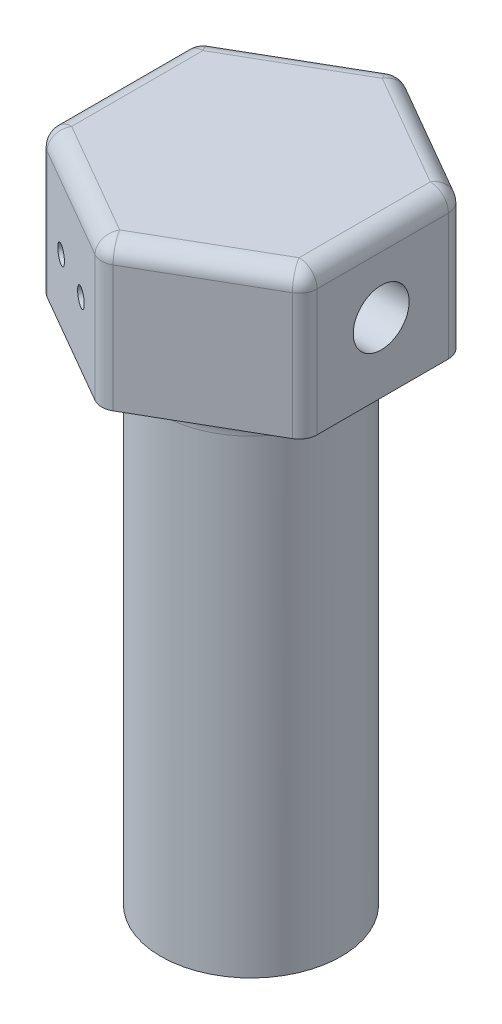
ISO-10303-21;
HEADER;
FILE_DESCRIPTION(('STEP AP214'),'2;1');
FILE_NAME('part.step','',(''),(''),'','','');
FILE_SCHEMA(('AUTOMOTIVE_DESIGN { 1 0 10303 214 1 1 1 1 }'));
ENDSEC;
DATA;
#1=APPLICATION_CONTEXT('core data for automotive mechanical design processes');
#2=APPLICATION_PROTOCOL_DEFINITION('international standard','automotive_design',2000,#1);
#3=PRODUCT_CONTEXT('',#1,'mechanical');
#4=PRODUCT('Part','Part','',(#3));
#5=PRODUCT_RELATED_PRODUCT_CATEGORY('part','',(#4));
#6=PRODUCT_DEFINITION_FORMATION('','',#4);
#7=PRODUCT_DEFINITION_CONTEXT('part definition',#1,'design');
#8=PRODUCT_DEFINITION('design','',#6,#7);
#9=PRODUCT_DEFINITION_SHAPE('','',#8);
#10=(LENGTH_UNIT() NAMED_UNIT(*) SI_UNIT(.MILLI.,.METRE.));
#11=(NAMED_UNIT(*) PLANE_ANGLE_UNIT() SI_UNIT($,.RADIAN.));
#12=(NAMED_UNIT(*) SI_UNIT($,.STERADIAN.) SOLID_ANGLE_UNIT());
#13=UNCERTAINTY_MEASURE_WITH_UNIT(LENGTH_MEASURE(1.E-05),#10,'distance_accuracy_value','');
#14=(GEOMETRIC_REPRESENTATION_CONTEXT(3) GLOBAL_UNCERTAINTY_ASSIGNED_CONTEXT((#13)) GLOBAL_UNIT_ASSIGNED_CONTEXT((#10,
#11,#12)) REPRESENTATION_CONTEXT('',''));
#15=CARTESIAN_POINT('',(0.,0.,0.));
#16=DIRECTION('',(0.,0.,1.));
#17=DIRECTION('',(1.,0.,0.));
#18=AXIS2_PLACEMENT_3D('',#15,#16,#17);
#19=CARTESIAN_POINT('',(-1.15,-28.,1.11242977306435));
#20=DIRECTION('',(1.,0.,0.));
#21=DIRECTION('',(0.,0.,-1.));
#22=AXIS2_PLACEMENT_3D('',#19,#20,#21);
#23=PLANE('',#22);
#24=DIRECTION('',(0.,1.,0.));
#25=VECTOR('',#24,1.);
#26=CARTESIAN_POINT('',(-1.15,-28.,1.11242977306435));
#27=LINE('',#26,#25);
#28=CARTESIAN_POINT('',(-1.15,-24.,1.11242977306435));
#29=VERTEX_POINT('',#28);
#30=CARTESIAN_POINT('',(-1.15,0.,1.11242977306435));
#31=VERTEX_POINT('',#30);
#32=EDGE_CURVE('E177',#29,#31,#27,.T.);
#33=ORIENTED_EDGE('',*,*,#32,.F.);
#34=DIRECTION('',(0.,0.,-1.));
#35=VECTOR('',#34,1.);
#36=CARTESIAN_POINT('',(-1.15,-24.,1.11242977306435));
#37=LINE('',#36,#35);
#38=CARTESIAN_POINT('',(-1.15,-24.,-1.11242977306435));
#39=VERTEX_POINT('',#38);
#40=EDGE_CURVE('E12',#29,#39,#37,.T.);
#41=ORIENTED_EDGE('',*,*,#40,.T.);
#42=DIRECTION('',(0.,1.,0.));
#43=VECTOR('',#42,1.);
#44=CARTESIAN_POINT('',(-1.15,-28.,-1.11242977306435));
#45=LINE('',#44,#43);
#46=CARTESIAN_POINT('',(-1.15,0.,-1.11242977306435));
#47=VERTEX_POINT('',#46);
#48=EDGE_CURVE('E179',#39,#47,#45,.T.);
#49=ORIENTED_EDGE('',*,*,#48,.T.);
#50=DIRECTION('',(0.,0.,-1.));
#51=VECTOR('',#50,1.);
#52=CARTESIAN_POINT('',(-1.15,0.,1.11242977306435));
#53=LINE('',#52,#51);
#54=EDGE_CURVE('E185',#31,#47,#53,.T.);
#55=ORIENTED_EDGE('',*,*,#54,.F.);
#56=EDGE_LOOP('',(#33,#41,#49,#55));
#57=FACE_BOUND('',#56,.T.);
#58=ADVANCED_FACE('F52',(#57),#23,.T.);
#59=CARTESIAN_POINT('',(0.,0.,0.));
#60=DIRECTION('',(0.,1.,0.));
#61=DIRECTION('',(0.,0.,1.));
#62=AXIS2_PLACEMENT_3D('',#59,#60,#61);
#63=PLANE('',#62);
#64=CARTESIAN_POINT('',(0.,0.,0.));
#65=DIRECTION('',(0.,1.,0.));
#66=DIRECTION('',(0.,0.,1.));
#67=AXIS2_PLACEMENT_3D('',#64,#65,#66);
#68=CIRCLE('',#67,7.);
#69=CARTESIAN_POINT('',(0.,0.,7.));
#70=VERTEX_POINT('',#69);
#71=EDGE_CURVE('E225',#70,#70,#68,.T.);
#72=ORIENTED_EDGE('',*,*,#71,.T.);
#73=EDGE_LOOP('',(#72));
#74=FACE_BOUND('',#73,.T.);
#75=DIRECTION('',(0.,0.,1.));
#76=VECTOR('',#75,1.);
#77=CARTESIAN_POINT('',(-7.3,0.,-4.21465696508427));
#78=LINE('',#77,#76);
#79=CARTESIAN_POINT('',(-7.3,0.,-3.63730669589464));
#80=VERTEX_POINT('',#79);
#81=CARTESIAN_POINT('',(-7.3,0.,3.63730669589464));
#82=VERTEX_POINT('',#81);
#83=EDGE_CURVE('E213',#80,#82,#78,.T.);
#84=ORIENTED_EDGE('',*,*,#83,.F.);
#85=CARTESIAN_POINT('',(-6.3,0.,-3.63730669589464));
#86=DIRECTION('',(0.,1.,0.));
#87=DIRECTION('',(0.,0.,1.));
#88=AXIS2_PLACEMENT_3D('',#85,#86,#87);
#89=CIRCLE('',#88,1.);
#90=CARTESIAN_POINT('',(-6.8,0.,-4.50333209967908));
#91=VERTEX_POINT('',#90);
#92=EDGE_CURVE('E61',#80,#91,#89,.F.);
#93=ORIENTED_EDGE('',*,*,#92,.T.);
#94=DIRECTION('',(-0.866025403784439,0.,0.5));
#95=VECTOR('',#94,1.);
#96=CARTESIAN_POINT('',(0.,0.,-8.42931393016854));
#97=LINE('',#96,#95);
#98=CARTESIAN_POINT('',(-0.5,0.,-8.14063879557373));
#99=VERTEX_POINT('',#98);
#100=EDGE_CURVE('E209',#99,#91,#97,.T.);
#101=ORIENTED_EDGE('',*,*,#100,.F.);
#102=CARTESIAN_POINT('',(0.,0.,-7.27461339178929));
#103=DIRECTION('',(0.,1.,0.));
#104=DIRECTION('',(0.,0.,1.));
#105=AXIS2_PLACEMENT_3D('',#102,#103,#104);
#106=CIRCLE('',#105,1.);
#107=CARTESIAN_POINT('',(0.5,0.,-8.14063879557372));
#108=VERTEX_POINT('',#107);
#109=EDGE_CURVE('E314',#99,#108,#106,.F.);
#110=ORIENTED_EDGE('',*,*,#109,.T.);
#111=DIRECTION('',(-0.866025403784439,0.,-0.5));
#112=VECTOR('',#111,1.);
#113=CARTESIAN_POINT('',(7.3,0.,-4.21465696508427));
#114=LINE('',#113,#112);
#115=CARTESIAN_POINT('',(6.8,0.,-4.50333209967908));
#116=VERTEX_POINT('',#115);
#117=EDGE_CURVE('E205',#116,#108,#114,.T.);
#118=ORIENTED_EDGE('',*,*,#117,.F.);
#119=CARTESIAN_POINT('',(6.3,0.,-3.63730669589465));
#120=DIRECTION('',(0.,1.,0.));
#121=DIRECTION('',(0.,0.,1.));
#122=AXIS2_PLACEMENT_3D('',#119,#120,#121);
#123=CIRCLE('',#122,1.);
#124=CARTESIAN_POINT('',(7.3,0.,-3.63730669589465));
#125=VERTEX_POINT('',#124);
#126=EDGE_CURVE('E311',#116,#125,#123,.F.);
#127=ORIENTED_EDGE('',*,*,#126,.T.);
#128=DIRECTION('',(0.,0.,-1.));
#129=VECTOR('',#128,1.);
#130=CARTESIAN_POINT('',(7.3,0.,4.21465696508427));
#131=LINE('',#130,#129);
#132=CARTESIAN_POINT('',(7.3,0.,3.63730669589464));
#133=VERTEX_POINT('',#132);
#134=EDGE_CURVE('E201',#133,#125,#131,.T.);
#135=ORIENTED_EDGE('',*,*,#134,.F.);
#136=CARTESIAN_POINT('',(6.3,0.,3.63730669589464));
#137=DIRECTION('',(0.,1.,0.));
#138=DIRECTION('',(0.,0.,1.));
#139=AXIS2_PLACEMENT_3D('',#136,#137,#138);
#140=CIRCLE('',#139,1.);
#141=CARTESIAN_POINT('',(6.8,0.,4.50333209967908));
#142=VERTEX_POINT('',#141);
#143=EDGE_CURVE('E308',#133,#142,#140,.F.);
#144=ORIENTED_EDGE('',*,*,#143,.T.);
#145=DIRECTION('',(0.866025403784439,0.,-0.5));
#146=VECTOR('',#145,1.);
#147=CARTESIAN_POINT('',(0.,0.,8.42931393016854));
#148=LINE('',#147,#146);
#149=CARTESIAN_POINT('',(0.500000000000001,0.,8.14063879557373));
#150=VERTEX_POINT('',#149);
#151=EDGE_CURVE('E193',#150,#142,#148,.T.);
#152=ORIENTED_EDGE('',*,*,#151,.F.);
#153=CARTESIAN_POINT('',(0.,0.,7.27461339178929));
#154=DIRECTION('',(0.,1.,0.));
#155=DIRECTION('',(0.,0.,1.));
#156=AXIS2_PLACEMENT_3D('',#153,#154,#155);
#157=CIRCLE('',#156,1.);
#158=CARTESIAN_POINT('',(-0.5,0.,8.14063879557373));
#159=VERTEX_POINT('',#158);
#160=EDGE_CURVE('E305',#150,#159,#157,.F.);
#161=ORIENTED_EDGE('',*,*,#160,.T.);
#162=DIRECTION('',(0.866025403784438,0.,0.5));
#163=VECTOR('',#162,1.);
#164=CARTESIAN_POINT('',(-7.3,0.,4.21465696508427));
#165=LINE('',#164,#163);
#166=CARTESIAN_POINT('',(-6.8,0.,4.50333209967908));
#167=VERTEX_POINT('',#166);
#168=EDGE_CURVE('E217',#167,#159,#165,.T.);
#169=ORIENTED_EDGE('',*,*,#168,.F.);
#170=CARTESIAN_POINT('',(-6.3,0.,3.63730669589464));
#171=DIRECTION('',(0.,1.,0.));
#172=DIRECTION('',(0.,0.,1.));
#173=AXIS2_PLACEMENT_3D('',#170,#171,#172);
#174=CIRCLE('',#173,1.);
#175=EDGE_CURVE('E302',#167,#82,#174,.F.);
#176=ORIENTED_EDGE('',*,*,#175,.T.);
#177=EDGE_LOOP('',(#84,#93,#101,#110,#118,#127,#135,#144,#152,#161,#169,#176));
#178=FACE_BOUND('',#177,.T.);
#179=ADVANCED_FACE('F412',(#74,#178),#63,.F.);
#180=CARTESIAN_POINT('',(0.,8.,8.42931393016854));
#181=DIRECTION('',(-0.5,0.,-0.866025403784439));
#182=DIRECTION('',(-0.866025403784439,0.,0.5));
#183=AXIS2_PLACEMENT_3D('',#180,#181,#182);
#184=PLANE('',#183);
#185=ORIENTED_EDGE('',*,*,#151,.T.);
#186=DIRECTION('',(0.,-1.,0.));
#187=VECTOR('',#186,1.);
#188=CARTESIAN_POINT('',(6.8,8.,4.50333209967908));
#189=LINE('',#188,#187);
#190=CARTESIAN_POINT('',(6.8,7.,4.50333209967908));
#191=VERTEX_POINT('',#190);
#192=EDGE_CURVE('E74',#142,#191,#189,.F.);
#193=ORIENTED_EDGE('',*,*,#192,.T.);
#194=DIRECTION('',(0.866025403784439,0.,-0.5));
#195=VECTOR('',#194,1.);
#196=CARTESIAN_POINT('',(0.,7.,8.42931393016854));
#197=LINE('',#196,#195);
#198=CARTESIAN_POINT('',(0.5,7.,8.14063879557373));
#199=VERTEX_POINT('',#198);
#200=EDGE_CURVE('E297',#191,#199,#197,.F.);
#201=ORIENTED_EDGE('',*,*,#200,.T.);
#202=DIRECTION('',(0.,-1.,0.));
#203=VECTOR('',#202,1.);
#204=CARTESIAN_POINT('',(0.5,8.,8.14063879557373));
#205=LINE('',#204,#203);
#206=EDGE_CURVE('E294',#199,#150,#205,.T.);
#207=ORIENTED_EDGE('',*,*,#206,.T.);
#208=EDGE_LOOP('',(#185,#193,#201,#207));
#209=FACE_BOUND('',#208,.T.);
#210=ADVANCED_FACE('F426',(#209),#184,.F.);
#211=CARTESIAN_POINT('',(7.3,8.,4.21465696508427));
#212=DIRECTION('',(-1.,0.,0.));
#213=DIRECTION('',(0.,0.,1.));
#214=AXIS2_PLACEMENT_3D('',#211,#212,#213);
#215=PLANE('',#214);
#216=CARTESIAN_POINT('',(7.3,3.85,0.0853430349157284));
#217=DIRECTION('',(1.,0.,0.));
#218=DIRECTION('',(0.,0.,-1.));
#219=AXIS2_PLACEMENT_3D('',#216,#217,#218);
#220=CIRCLE('',#219,1.55);
#221=CARTESIAN_POINT('',(7.3,3.85,-1.46465696508427));
#222=VERTEX_POINT('',#221);
#223=EDGE_CURVE('E386',#222,#222,#220,.T.);
#224=ORIENTED_EDGE('',*,*,#223,.F.);
#225=EDGE_LOOP('',(#224));
#226=FACE_BOUND('',#225,.T.);
#227=ORIENTED_EDGE('',*,*,#134,.T.);
#228=DIRECTION('',(0.,-1.,0.));
#229=VECTOR('',#228,1.);
#230=CARTESIAN_POINT('',(7.3,8.,-3.63730669589465));
#231=LINE('',#230,#229);
#232=CARTESIAN_POINT('',(7.3,7.,-3.63730669589465));
#233=VERTEX_POINT('',#232);
#234=EDGE_CURVE('E291',#125,#233,#231,.F.);
#235=ORIENTED_EDGE('',*,*,#234,.T.);
#236=DIRECTION('',(0.,0.,-1.));
#237=VECTOR('',#236,1.);
#238=CARTESIAN_POINT('',(7.3,7.,4.21465696508427));
#239=LINE('',#238,#237);
#240=CARTESIAN_POINT('',(7.3,7.,3.63730669589464));
#241=VERTEX_POINT('',#240);
#242=EDGE_CURVE('E288',#233,#241,#239,.F.);
#243=ORIENTED_EDGE('',*,*,#242,.T.);
#244=DIRECTION('',(0.,-1.,0.));
#245=VECTOR('',#244,1.);
#246=CARTESIAN_POINT('',(7.3,8.,3.63730669589464));
#247=LINE('',#246,#245);
#248=EDGE_CURVE('E285',#241,#133,#247,.T.);
#249=ORIENTED_EDGE('',*,*,#248,.T.);
#250=EDGE_LOOP('',(#227,#235,#243,#249));
#251=FACE_BOUND('',#250,.T.);
#252=ADVANCED_FACE('F491',(#226,#251),#215,.F.);
#253=CARTESIAN_POINT('',(7.3,8.,-4.21465696508427));
#254=DIRECTION('',(-0.5,0.,0.866025403784439));
#255=DIRECTION('',(0.866025403784439,0.,0.5));
#256=AXIS2_PLACEMENT_3D('',#253,#254,#255);
#257=PLANE('',#256);
#258=ORIENTED_EDGE('',*,*,#117,.T.);
#259=DIRECTION('',(0.,-1.,0.));
#260=VECTOR('',#259,1.);
#261=CARTESIAN_POINT('',(0.5,8.,-8.14063879557372));
#262=LINE('',#261,#260);
#263=CARTESIAN_POINT('',(0.499999999999999,7.,-8.14063879557372));
#264=VERTEX_POINT('',#263);
#265=EDGE_CURVE('E282',#108,#264,#262,.F.);
#266=ORIENTED_EDGE('',*,*,#265,.T.);
#267=DIRECTION('',(-0.866025403784439,0.,-0.5));
#268=VECTOR('',#267,1.);
#269=CARTESIAN_POINT('',(7.3,7.,-4.21465696508427));
#270=LINE('',#269,#268);
#271=CARTESIAN_POINT('',(6.8,7.,-4.50333209967908));
#272=VERTEX_POINT('',#271);
#273=EDGE_CURVE('E279',#264,#272,#270,.F.);
#274=ORIENTED_EDGE('',*,*,#273,.T.);
#275=DIRECTION('',(0.,-1.,0.));
#276=VECTOR('',#275,1.);
#277=CARTESIAN_POINT('',(6.8,8.,-4.50333209967908));
#278=LINE('',#277,#276);
#279=EDGE_CURVE('E276',#272,#116,#278,.T.);
#280=ORIENTED_EDGE('',*,*,#279,.T.);
#281=EDGE_LOOP('',(#258,#266,#274,#280));
#282=FACE_BOUND('',#281,.T.);
#283=ADVANCED_FACE('F540',(#282),#257,.F.);
#284=CARTESIAN_POINT('',(0.,8.,-8.42931393016854));
#285=DIRECTION('',(0.5,0.,0.866025403784439));
#286=DIRECTION('',(0.866025403784439,0.,-0.5));
#287=AXIS2_PLACEMENT_3D('',#284,#285,#286);
#288=PLANE('',#287);
#289=ORIENTED_EDGE('',*,*,#100,.T.);
#290=DIRECTION('',(0.,-1.,0.));
#291=VECTOR('',#290,1.);
#292=CARTESIAN_POINT('',(-6.8,8.,-4.50333209967908));
#293=LINE('',#292,#291);
#294=CARTESIAN_POINT('',(-6.8,7.,-4.50333209967908));
#295=VERTEX_POINT('',#294);
#296=EDGE_CURVE('E273',#91,#295,#293,.F.);
#297=ORIENTED_EDGE('',*,*,#296,.T.);
#298=DIRECTION('',(-0.866025403784439,0.,0.5));
#299=VECTOR('',#298,1.);
#300=CARTESIAN_POINT('',(0.,7.,-8.42931393016854));
#301=LINE('',#300,#299);
#302=CARTESIAN_POINT('',(-0.500000000000001,7.,-8.14063879557373));
#303=VERTEX_POINT('',#302);
#304=EDGE_CURVE('E270',#295,#303,#301,.F.);
#305=ORIENTED_EDGE('',*,*,#304,.T.);
#306=DIRECTION('',(0.,-1.,0.));
#307=VECTOR('',#306,1.);
#308=CARTESIAN_POINT('',(-0.500000000000001,8.,-8.14063879557373));
#309=LINE('',#308,#307);
#310=EDGE_CURVE('E267',#303,#99,#309,.T.);
#311=ORIENTED_EDGE('',*,*,#310,.T.);
#312=EDGE_LOOP('',(#289,#297,#305,#311));
#313=FACE_BOUND('',#312,.T.);
#314=ADVANCED_FACE('F590',(#313),#288,.F.);
#315=CARTESIAN_POINT('',(-7.3,8.,-4.21465696508427));
#316=DIRECTION('',(1.,0.,0.));
#317=DIRECTION('',(0.,0.,-1.));
#318=AXIS2_PLACEMENT_3D('',#315,#316,#317);
#319=PLANE('',#318);
#320=CARTESIAN_POINT('',(-7.3,3.85,0.0853430349157314));
#321=DIRECTION('',(1.,0.,0.));
#322=DIRECTION('',(0.,0.,-1.));
#323=AXIS2_PLACEMENT_3D('',#320,#321,#322);
#324=CIRCLE('',#323,1.55);
#325=CARTESIAN_POINT('',(-7.3,3.85,-1.46465696508427));
#326=VERTEX_POINT('',#325);
#327=EDGE_CURVE('E392',#326,#326,#324,.T.);
#328=ORIENTED_EDGE('',*,*,#327,.T.);
#329=EDGE_LOOP('',(#328));
#330=FACE_BOUND('',#329,.T.);
#331=DIRECTION('',(0.,0.,1.));
#332=VECTOR('',#331,1.);
#333=CARTESIAN_POINT('',(-7.3,7.,-4.21465696508427));
#334=LINE('',#333,#332);
#335=CARTESIAN_POINT('',(-7.3,7.,3.63730669589464));
#336=VERTEX_POINT('',#335);
#337=CARTESIAN_POINT('',(-7.3,7.,-3.63730669589464));
#338=VERTEX_POINT('',#337);
#339=EDGE_CURVE('E261',#336,#338,#334,.F.);
#340=ORIENTED_EDGE('',*,*,#339,.T.);
#341=DIRECTION('',(0.,-1.,0.));
#342=VECTOR('',#341,1.);
#343=CARTESIAN_POINT('',(-7.3,8.,-3.63730669589464));
#344=LINE('',#343,#342);
#345=EDGE_CURVE('E264',#338,#80,#344,.T.);
#346=ORIENTED_EDGE('',*,*,#345,.T.);
#347=ORIENTED_EDGE('',*,*,#83,.T.);
#348=DIRECTION('',(0.,-1.,0.));
#349=VECTOR('',#348,1.);
#350=CARTESIAN_POINT('',(-7.3,8.,3.63730669589464));
#351=LINE('',#350,#349);
#352=EDGE_CURVE('E258',#82,#336,#351,.F.);
#353=ORIENTED_EDGE('',*,*,#352,.T.);
#354=EDGE_LOOP('',(#340,#346,#347,#353));
#355=FACE_BOUND('',#354,.T.);
#356=ADVANCED_FACE('F448',(#330,#355),#319,.F.);
#357=CARTESIAN_POINT('',(-7.3,8.,4.21465696508427));
#358=DIRECTION('',(0.5,0.,-0.866025403784439));
#359=DIRECTION('',(-0.866025403784438,0.,-0.5));
#360=AXIS2_PLACEMENT_3D('',#357,#358,#359);
#361=PLANE('',#360);
#362=CARTESIAN_POINT('',(-4.94903810567666,3.5,5.5719854476264));
#363=DIRECTION('',(-0.5,0.,0.866025403784439));
#364=DIRECTION('',(0.866025403784439,0.,0.5));
#365=AXIS2_PLACEMENT_3D('',#362,#363,#364);
#366=CIRCLE('',#365,0.5);
#367=CARTESIAN_POINT('',(-4.51602540378444,3.5,5.8219854476264));
#368=VERTEX_POINT('',#367);
#369=EDGE_CURVE('E922',#368,#368,#366,.T.);
#370=ORIENTED_EDGE('',*,*,#369,.F.);
#371=EDGE_LOOP('',(#370));
#372=FACE_BOUND('',#371,.T.);
#373=CARTESIAN_POINT('',(-2.35096189432334,3.5,7.0719854476264));
#374=DIRECTION('',(-0.5,0.,0.866025403784439));
#375=DIRECTION('',(0.866025403784439,0.,0.5));
#376=AXIS2_PLACEMENT_3D('',#373,#374,#375);
#377=CIRCLE('',#376,0.499999999999999);
#378=CARTESIAN_POINT('',(-1.91794919243112,3.5,7.3219854476264));
#379=VERTEX_POINT('',#378);
#380=EDGE_CURVE('E926',#379,#379,#377,.T.);
#381=ORIENTED_EDGE('',*,*,#380,.F.);
#382=EDGE_LOOP('',(#381));
#383=FACE_BOUND('',#382,.T.);
#384=ORIENTED_EDGE('',*,*,#168,.T.);
#385=DIRECTION('',(0.,-1.,0.));
#386=VECTOR('',#385,1.);
#387=CARTESIAN_POINT('',(-0.5,8.,8.14063879557373));
#388=LINE('',#387,#386);
#389=CARTESIAN_POINT('',(-0.5,7.,8.14063879557373));
#390=VERTEX_POINT('',#389);
#391=EDGE_CURVE('E255',#159,#390,#388,.F.);
#392=ORIENTED_EDGE('',*,*,#391,.T.);
#393=DIRECTION('',(0.866025403784438,0.,0.5));
#394=VECTOR('',#393,1.);
#395=CARTESIAN_POINT('',(-7.3,7.,4.21465696508427));
#396=LINE('',#395,#394);
#397=CARTESIAN_POINT('',(-6.8,7.,4.50333209967908));
#398=VERTEX_POINT('',#397);
#399=EDGE_CURVE('E251',#390,#398,#396,.F.);
#400=ORIENTED_EDGE('',*,*,#399,.T.);
#401=DIRECTION('',(0.,-1.,0.));
#402=VECTOR('',#401,1.);
#403=CARTESIAN_POINT('',(-6.8,8.,4.50333209967908));
#404=LINE('',#403,#402);
#405=EDGE_CURVE('E248',#398,#167,#404,.T.);
#406=ORIENTED_EDGE('',*,*,#405,.T.);
#407=EDGE_LOOP('',(#384,#392,#400,#406));
#408=FACE_BOUND('',#407,.T.);
#409=ADVANCED_FACE('F443',(#372,#383,#408),#361,.F.);
#410=CARTESIAN_POINT('',(0.,8.,0.));
#411=DIRECTION('',(0.,1.,0.));
#412=DIRECTION('',(0.,0.,1.));
#413=AXIS2_PLACEMENT_3D('',#410,#411,#412);
#414=PLANE('',#413);
#415=DIRECTION('',(0.,0.,1.));
#416=VECTOR('',#415,1.);
#417=CARTESIAN_POINT('',(-6.3,8.,4.21465696508427));
#418=LINE('',#417,#416);
#419=CARTESIAN_POINT('',(-6.3,8.,-3.63730669589464));
#420=VERTEX_POINT('',#419);
#421=CARTESIAN_POINT('',(-6.3,8.,3.63730669589464));
#422=VERTEX_POINT('',#421);
#423=EDGE_CURVE('E241',#420,#422,#418,.T.);
#424=ORIENTED_EDGE('',*,*,#423,.T.);
#425=DIRECTION('',(0.866025403784438,0.,0.5));
#426=VECTOR('',#425,1.);
#427=CARTESIAN_POINT('',(0.499999999999999,8.,7.5632885263841));
#428=LINE('',#427,#426);
#429=CARTESIAN_POINT('',(0.,8.,7.27461339178929));
#430=VERTEX_POINT('',#429);
#431=EDGE_CURVE('E244',#422,#430,#428,.T.);
#432=ORIENTED_EDGE('',*,*,#431,.T.);
#433=DIRECTION('',(0.866025403784439,0.,-0.5));
#434=VECTOR('',#433,1.);
#435=CARTESIAN_POINT('',(6.8,8.,3.34863156129983));
#436=LINE('',#435,#434);
#437=CARTESIAN_POINT('',(6.3,8.,3.63730669589465));
#438=VERTEX_POINT('',#437);
#439=EDGE_CURVE('E229',#430,#438,#436,.T.);
#440=ORIENTED_EDGE('',*,*,#439,.T.);
#441=DIRECTION('',(0.,0.,-1.));
#442=VECTOR('',#441,1.);
#443=CARTESIAN_POINT('',(6.3,8.,-4.21465696508427));
#444=LINE('',#443,#442);
#445=CARTESIAN_POINT('',(6.3,8.,-3.63730669589465));
#446=VERTEX_POINT('',#445);
#447=EDGE_CURVE('E232',#438,#446,#444,.T.);
#448=ORIENTED_EDGE('',*,*,#447,.T.);
#449=DIRECTION('',(-0.866025403784439,0.,-0.5));
#450=VECTOR('',#449,1.);
#451=CARTESIAN_POINT('',(-0.500000000000001,8.,-7.5632885263841));
#452=LINE('',#451,#450);
#453=CARTESIAN_POINT('',(0.,8.,-7.27461339178929));
#454=VERTEX_POINT('',#453);
#455=EDGE_CURVE('E235',#446,#454,#452,.T.);
#456=ORIENTED_EDGE('',*,*,#455,.T.);
#457=DIRECTION('',(-0.866025403784439,0.,0.5));
#458=VECTOR('',#457,1.);
#459=CARTESIAN_POINT('',(-6.8,8.,-3.34863156129983));
#460=LINE('',#459,#458);
#461=EDGE_CURVE('E238',#454,#420,#460,.T.);
#462=ORIENTED_EDGE('',*,*,#461,.T.);
#463=EDGE_LOOP('',(#424,#432,#440,#448,#456,#462));
#464=FACE_BOUND('',#463,.T.);
#465=ADVANCED_FACE('F438',(#464),#414,.T.);
#466=CARTESIAN_POINT('',(0.,-28.,0.));
#467=DIRECTION('',(0.,-1.,0.));
#468=DIRECTION('',(0.,0.,-1.));
#469=AXIS2_PLACEMENT_3D('',#466,#467,#468);
#470=PLANE('',#469);
#471=CARTESIAN_POINT('',(0.,-28.,0.));
#472=DIRECTION('',(0.,-1.,0.));
#473=DIRECTION('',(0.,0.,-1.));
#474=AXIS2_PLACEMENT_3D('',#471,#472,#473);
#475=CIRCLE('',#474,1.6);
#476=CARTESIAN_POINT('',(0.,-28.,-1.6));
#477=VERTEX_POINT('',#476);
#478=EDGE_CURVE('E195',#477,#477,#475,.T.);
#479=ORIENTED_EDGE('',*,*,#478,.F.);
#480=EDGE_LOOP('',(#479));
#481=FACE_BOUND('',#480,.T.);
#482=CARTESIAN_POINT('',(0.,-28.,0.));
#483=DIRECTION('',(0.,-1.,0.));
#484=DIRECTION('',(0.,0.,-1.));
#485=AXIS2_PLACEMENT_3D('',#482,#483,#484);
#486=CIRCLE('',#485,5.);
#487=CARTESIAN_POINT('',(0.,-28.,-5.));
#488=VERTEX_POINT('',#487);
#489=EDGE_CURVE('E188',#488,#488,#486,.T.);
#490=ORIENTED_EDGE('',*,*,#489,.T.);
#491=EDGE_LOOP('',(#490));
#492=FACE_BOUND('',#491,.T.);
#493=ADVANCED_FACE('F435',(#481,#492),#470,.T.);
#494=CARTESIAN_POINT('',(0.,-28.,0.));
#495=DIRECTION('',(0.,1.,0.));
#496=DIRECTION('',(0.,0.,1.));
#497=AXIS2_PLACEMENT_3D('',#494,#495,#496);
#498=CYLINDRICAL_SURFACE('',#497,5.);
#499=CARTESIAN_POINT('',(0.,-2.,0.));
#500=DIRECTION('',(0.,1.,0.));
#501=DIRECTION('',(0.,0.,1.));
#502=AXIS2_PLACEMENT_3D('',#499,#500,#501);
#503=CIRCLE('',#502,5.);
#504=CARTESIAN_POINT('',(0.,-2.,5.));
#505=VERTEX_POINT('',#504);
#506=EDGE_CURVE('E221',#505,#505,#503,.F.);
#507=ORIENTED_EDGE('',*,*,#506,.T.);
#508=EDGE_LOOP('',(#507));
#509=FACE_BOUND('',#508,.T.);
#510=ORIENTED_EDGE('',*,*,#489,.F.);
#511=EDGE_LOOP('',(#510));
#512=FACE_BOUND('',#511,.T.);
#513=ADVANCED_FACE('F420',(#509,#512),#498,.T.);
#514=CARTESIAN_POINT('',(0.,-28.,0.));
#515=DIRECTION('',(0.,1.,0.));
#516=DIRECTION('',(0.,0.,1.));
#517=AXIS2_PLACEMENT_3D('',#514,#515,#516);
#518=CYLINDRICAL_SURFACE('',#517,1.6);
#519=CARTESIAN_POINT('',(0.,-24.,0.));
#520=DIRECTION('',(0.,-1.,0.));
#521=DIRECTION('',(0.,0.,-1.));
#522=AXIS2_PLACEMENT_3D('',#519,#520,#521);
#523=CIRCLE('',#522,1.6);
#524=EDGE_CURVE('E67',#29,#39,#523,.T.);
#525=ORIENTED_EDGE('',*,*,#524,.F.);
#526=ORIENTED_EDGE('',*,*,#32,.T.);
#527=CARTESIAN_POINT('',(0.,0.,0.));
#528=DIRECTION('',(0.,-1.,0.));
#529=DIRECTION('',(0.,0.,-1.));
#530=AXIS2_PLACEMENT_3D('',#527,#528,#529);
#531=CIRCLE('',#530,1.6);
#532=EDGE_CURVE('E398',#47,#31,#531,.T.);
#533=ORIENTED_EDGE('',*,*,#532,.F.);
#534=ORIENTED_EDGE('',*,*,#48,.F.);
#535=EDGE_LOOP('',(#525,#526,#533,#534));
#536=FACE_BOUND('',#535,.T.);
#537=ORIENTED_EDGE('',*,*,#478,.T.);
#538=EDGE_LOOP('',(#537));
#539=FACE_BOUND('',#538,.T.);
#540=ADVANCED_FACE('F174',(#536,#539),#518,.F.);
#541=CARTESIAN_POINT('',(0.,0.,0.));
#542=DIRECTION('',(0.,-1.,0.));
#543=DIRECTION('',(0.,0.,-1.));
#544=AXIS2_PLACEMENT_3D('',#541,#542,#543);
#545=CIRCLE('',#544,1.);
#546=CARTESIAN_POINT('',(0.,0.,-1.));
#547=VERTEX_POINT('',#546);
#548=EDGE_CURVE('E918',#547,#547,#545,.T.);
#549=ORIENTED_EDGE('',*,*,#548,.F.);
#550=EDGE_LOOP('',(#549));
#551=FACE_BOUND('',#550,.T.);
#552=ORIENTED_EDGE('',*,*,#54,.T.);
#553=ORIENTED_EDGE('',*,*,#532,.T.);
#554=EDGE_LOOP('',(#552,#553));
#555=FACE_BOUND('',#554,.T.);
#556=ADVANCED_FACE('F407',(#551,#555),#63,.F.);
#557=CARTESIAN_POINT('',(0.,-2.,0.));
#558=DIRECTION('',(0.,1.,0.));
#559=DIRECTION('',(0.,0.,1.));
#560=AXIS2_PLACEMENT_3D('',#557,#558,#559);
#561=TOROIDAL_SURFACE('',#560,7.,2.);
#562=ORIENTED_EDGE('',*,*,#71,.F.);
#563=EDGE_LOOP('',(#562));
#564=FACE_BOUND('',#563,.T.);
#565=ORIENTED_EDGE('',*,*,#506,.F.);
#566=EDGE_LOOP('',(#565));
#567=FACE_BOUND('',#566,.T.);
#568=ADVANCED_FACE('F409',(#564,#567),#561,.F.);
#569=CARTESIAN_POINT('',(-7.3,3.85,0.0853430349157314));
#570=DIRECTION('',(1.,0.,0.));
#571=DIRECTION('',(0.,0.,-1.));
#572=AXIS2_PLACEMENT_3D('',#569,#570,#571);
#573=CYLINDRICAL_SURFACE('',#572,1.55);
#574=CARTESIAN_POINT('',(0.,2.74341493930204,-1.));
#575=CARTESIAN_POINT('',(-0.0477615376924183,2.74340630891303,-0.999995180119674));
#576=CARTESIAN_POINT('',(-0.0955602316165777,2.73999213443421,-0.996543521383466));
#577=CARTESIAN_POINT('',(-0.189385120764305,2.72700974783904,-0.983053964103117));
#578=CARTESIAN_POINT('',(-0.235407095369821,2.71742773571983,-0.973001295352921));
#579=CARTESIAN_POINT('',(-0.323978355710755,2.69384279140232,-0.947177889390825));
#580=CARTESIAN_POINT('',(-0.366559793924961,2.67988875162289,-0.93147011684342));
#581=CARTESIAN_POINT('',(-0.448346617760416,2.64915388088981,-0.894982056281887));
#582=CARTESIAN_POINT('',(-0.487551628224776,2.63237273642567,-0.874201205576173));
#583=CARTESIAN_POINT('',(-0.568803155810809,2.59437592921007,-0.824083477352815));
#584=CARTESIAN_POINT('',(-0.610196406985713,2.5728917742098,-0.793892175866233));
#585=CARTESIAN_POINT('',(-0.687892040647773,2.52970534563059,-0.727609183238996));
#586=CARTESIAN_POINT('',(-0.724188368779695,2.50800284492534,-0.691510583480061));
#587=CARTESIAN_POINT('',(-0.7974432799396,2.46195797498508,-0.606460422334165));
#588=CARTESIAN_POINT('',(-0.83326099356015,2.43787894224611,-0.556367465730331));
#589=CARTESIAN_POINT('',(-0.895630194792806,2.3938990596254,-0.449085324135714));
#590=CARTESIAN_POINT('',(-0.922196681688824,2.37399146753814,-0.391907831551283));
#591=CARTESIAN_POINT('',(-0.959157879568574,2.34462806999574,-0.286880263225941));
#592=CARTESIAN_POINT('',(-0.971931150101111,2.33380425674797,-0.240245827507927));
#593=CARTESIAN_POINT('',(-0.990641763731923,2.31642627059434,-0.144861386873152));
#594=CARTESIAN_POINT('',(-0.996584753313161,2.30986857290887,-0.0961131640403499));
#595=CARTESIAN_POINT('',(-1.00121233331573,2.30143857732235,0.00226852432855452));
#596=CARTESIAN_POINT('',(-0.999877490550976,2.29957884324141,0.051904006875161));
#597=CARTESIAN_POINT('',(-0.989866146582662,2.30058223414813,0.150383557309012));
#598=CARTESIAN_POINT('',(-0.981188297339847,2.30344622641563,0.199227478202186));
#599=CARTESIAN_POINT('',(-0.957340680309983,2.31325501391324,0.29281806272054));
#600=CARTESIAN_POINT('',(-0.942434705227931,2.3200378577339,0.337650117452509));
#601=CARTESIAN_POINT('',(-0.906758405290767,2.33685988594383,0.424245440156535));
#602=CARTESIAN_POINT('',(-0.885987061946117,2.34689963592237,0.466008173568842));
#603=CARTESIAN_POINT('',(-0.837179573766828,2.37035984211292,0.549232190626226));
#604=CARTESIAN_POINT('',(-0.808669386508989,2.38399808112239,0.590352753023557));
#605=CARTESIAN_POINT('',(-0.746190181225601,2.41292079154612,0.667586725342083));
#606=CARTESIAN_POINT('',(-0.712215988976335,2.42820681878931,0.703695328122872));
#607=CARTESIAN_POINT('',(-0.634224933771185,2.4613480088638,0.775205100594079));
#608=CARTESIAN_POINT('',(-0.589466982616842,2.47925937307638,0.80977532093781));
#609=CARTESIAN_POINT('',(-0.49432525315671,2.51347609930133,0.871115631206596));
#610=CARTESIAN_POINT('',(-0.443943612062725,2.52978206702021,0.897888670484495));
#611=CARTESIAN_POINT('',(-0.347074252266131,2.55610483466742,0.93905995537851));
#612=CARTESIAN_POINT('',(-0.301308207552749,2.56671487765264,0.954769055363433));
#613=CARTESIAN_POINT('',(-0.207283115768595,2.58380841507813,0.979484000235784));
#614=CARTESIAN_POINT('',(-0.159027700756246,2.59029774737412,0.98849933133958));
#615=CARTESIAN_POINT('',(-0.0610280098285265,2.59815098168228,0.999357685722682));
#616=CARTESIAN_POINT('',(-0.0112773815164115,2.5994885005162,1.00116379122621));
#617=CARTESIAN_POINT('',(0.0877952537154598,2.59672124004159,0.997371926695607));
#618=CARTESIAN_POINT('',(0.137117127106779,2.5926148224096,0.991771727775164));
#619=CARTESIAN_POINT('',(0.230115031403701,2.5801630311463,0.974227618449301));
#620=CARTESIAN_POINT('',(0.273936795203636,2.57215942202221,0.96279208870519));
#621=CARTESIAN_POINT('',(0.359044954369046,2.55312110799285,0.934399020910785));
#622=CARTESIAN_POINT('',(0.400330328088341,2.5420851913564,0.917439274841681));
#623=CARTESIAN_POINT('',(0.485152924715343,2.51649360590193,0.875869020670132));
#624=CARTESIAN_POINT('',(0.528253669663796,2.50166465028373,0.850538934019554));
#625=CARTESIAN_POINT('',(0.610024022355307,2.47107976877399,0.793943933307047));
#626=CARTESIAN_POINT('',(0.648689737347227,2.45532304663468,0.762673868530601));
#627=CARTESIAN_POINT('',(0.72704570218926,2.42172577654886,0.689021112210143));
#628=CARTESIAN_POINT('',(0.765857964890208,2.403968878203,0.645656553886974));
#629=CARTESIAN_POINT('',(0.8357686302831,2.37114152151498,0.552171585111312));
#630=CARTESIAN_POINT('',(0.866867966256486,2.35607073820904,0.50205199316691));
#631=CARTESIAN_POINT('',(0.919265455333642,2.33090383386591,0.397798588076245));
#632=CARTESIAN_POINT('',(0.940840198372434,2.32066662656699,0.343839777332021));
#633=CARTESIAN_POINT('',(0.974381496201345,2.30596141692166,0.232290325306761));
#634=CARTESIAN_POINT('',(0.986362010013795,2.30148502715324,0.174705092408707));
#635=CARTESIAN_POINT('',(0.999038109330528,2.29930972417434,0.0666588087430661));
#636=CARTESIAN_POINT('',(1.00111626282354,2.30072349498776,0.01637320938365));
#637=CARTESIAN_POINT('',(0.99775475018701,2.30841669801022,-0.0835645325134621));
#638=CARTESIAN_POINT('',(0.992315921379061,2.31469558825618,-0.133216744982806));
#639=CARTESIAN_POINT('',(0.974794424695807,2.33127795200612,-0.22800672292574));
#640=CARTESIAN_POINT('',(0.963051431121197,2.34136845506475,-0.273246427966209));
#641=CARTESIAN_POINT('',(0.933764464715956,2.36491964412571,-0.360858814052385));
#642=CARTESIAN_POINT('',(0.916219534117159,2.37838088647149,-0.403231020346988));
#643=CARTESIAN_POINT('',(0.873972141716408,2.40936420007912,-0.488528204776039));
#644=CARTESIAN_POINT('',(0.848729668263772,2.42715763217356,-0.531085371857525));
#645=CARTESIAN_POINT('',(0.792779519814964,2.46475050759196,-0.611476482964001));
#646=CARTESIAN_POINT('',(0.762066551598814,2.4845518857288,-0.649305791467249));
#647=CARTESIAN_POINT('',(0.690109778374383,2.52840586917102,-0.725922422417501));
#648=CARTESIAN_POINT('',(0.647963325704063,2.55260862462615,-0.763777908293295));
#649=CARTESIAN_POINT('',(0.557505066395964,2.59999467462876,-0.832106158790564));
#650=CARTESIAN_POINT('',(0.509192731039798,2.62317788152147,-0.862578289646341));
#651=CARTESIAN_POINT('',(0.41731245885248,2.66143281997077,-0.909913942834042));
#652=CARTESIAN_POINT('',(0.374811623985538,2.67719225487796,-0.928287319627488));
#653=CARTESIAN_POINT('',(0.286538956392375,2.70463722692947,-0.959201877786151));
#654=CARTESIAN_POINT('',(0.240776271890721,2.71633365634499,-0.971758683108559));
#655=CARTESIAN_POINT('',(0.162273032909866,2.73103906156177,-0.987270699087481));
#656=CARTESIAN_POINT('',(0.130181183810283,2.73563897185112,-0.992024050435869));
#657=CARTESIAN_POINT('',(0.0653986366637319,2.74182963555011,-0.998390110902156));
#658=CARTESIAN_POINT('',(0.0327080310541045,2.74342084956048,-1.0000033007479));
#659=CARTESIAN_POINT('',(0.,2.74341493930204,-1.));
#660=B_SPLINE_CURVE_WITH_KNOTS('',3,(#574,#575,#576,#577,#578,#579,#580,#581,#582,#583,#584,
#585,#586,#587,#588,#589,#590,#591,#592,#593,#594,#595,#596,#597,#598,#599,#600,#601,#602,#603,
#604,#605,#606,#607,#608,#609,#610,#611,#612,#613,#614,#615,#616,#617,#618,#619,#620,#621,#622,
#623,#624,#625,#626,#627,#628,#629,#630,#631,#632,#633,#634,#635,#636,#637,#638,#639,#640,#641,
#642,#643,#644,#645,#646,#647,#648,#649,#650,#651,#652,#653,#654,#655,#656,#657,#658,#659),
.UNSPECIFIED.,.T.,.F.,(4,2,2,2,2,2,2,2,2,2,2,2,2,2,2,2,2,2,2,2,2,2,2,2,2,2,2,2,2,2,2,2,2,2,2,2,
2,2,2,2,2,2,4),(0.,0.143127673840373,0.286576701854587,0.428475586555567,0.570390217439231,
0.736474898344034,0.902755222878902,1.10007150842681,1.29706637331302,1.44508053191692,
1.59297224139284,1.74125904272114,1.88957307265238,2.03215648632541,2.17476467407975,
2.32974945742711,2.48488187965198,2.66207704466197,2.839205096716,2.98721117129204,
3.13500709346927,3.28355890127659,3.43215542510283,3.56958443430629,3.70706844116835,
3.86292694987758,4.01892122977052,4.20057949221881,4.38221576287351,4.55816032786248,
4.73384843670252,4.88410350972777,5.03434184709052,5.17719616042906,5.32007406755532,
5.47722832859751,5.63453548555026,5.81860377443028,6.00268785760343,6.14892033145809,
6.29475769778019,6.39278932475588,6.49080594287276),.UNSPECIFIED.);
#661=CARTESIAN_POINT('',(0.,2.74341493930204,-1.));
#662=VERTEX_POINT('',#661);
#663=EDGE_CURVE('E909',#662,#662,#660,.T.);
#664=ORIENTED_EDGE('',*,*,#663,.F.);
#665=EDGE_LOOP('',(#664));
#666=FACE_BOUND('',#665,.T.);
#667=ORIENTED_EDGE('',*,*,#327,.F.);
#668=EDGE_LOOP('',(#667));
#669=FACE_BOUND('',#668,.T.);
#670=ORIENTED_EDGE('',*,*,#223,.T.);
#671=EDGE_LOOP('',(#670));
#672=FACE_BOUND('',#671,.T.);
#673=ADVANCED_FACE('F417',(#666,#669,#672),#573,.F.);
#674=CARTESIAN_POINT('',(0.,8.,-7.27461339178929));
#675=DIRECTION('',(0.,-1.,0.));
#676=DIRECTION('',(0.,0.,-1.));
#677=AXIS2_PLACEMENT_3D('',#674,#675,#676);
#678=CYLINDRICAL_SURFACE('',#677,1.);
#679=ORIENTED_EDGE('',*,*,#109,.F.);
#680=ORIENTED_EDGE('',*,*,#310,.F.);
#681=CARTESIAN_POINT('',(0.,7.,-7.27461339178929));
#682=DIRECTION('',(0.,1.,0.));
#683=DIRECTION('',(0.,0.,1.));
#684=AXIS2_PLACEMENT_3D('',#681,#682,#683);
#685=CIRCLE('',#684,1.);
#686=EDGE_CURVE('E383',#264,#303,#685,.T.);
#687=ORIENTED_EDGE('',*,*,#686,.F.);
#688=ORIENTED_EDGE('',*,*,#265,.F.);
#689=EDGE_LOOP('',(#679,#680,#687,#688));
#690=FACE_BOUND('',#689,.T.);
#691=ADVANCED_FACE('F54',(#690),#678,.T.);
#692=CARTESIAN_POINT('',(3.15,7.,-5.45596004384197));
#693=DIRECTION('',(0.866025403784439,0.,0.5));
#694=DIRECTION('',(0.5,0.,-0.866025403784439));
#695=AXIS2_PLACEMENT_3D('',#692,#693,#694);
#696=CYLINDRICAL_SURFACE('',#695,1.);
#697=CARTESIAN_POINT('',(6.3,7.,-3.63730669589465));
#698=DIRECTION('',(0.866025403784439,0.,0.5));
#699=DIRECTION('',(0.5,0.,-0.866025403784439));
#700=AXIS2_PLACEMENT_3D('',#697,#698,#699);
#701=CIRCLE('',#700,1.);
#702=EDGE_CURVE('E376',#272,#446,#701,.T.);
#703=ORIENTED_EDGE('',*,*,#702,.F.);
#704=ORIENTED_EDGE('',*,*,#273,.F.);
#705=CARTESIAN_POINT('',(0.,7.,-7.27461339178929));
#706=DIRECTION('',(-0.866025403784438,0.,-0.5));
#707=DIRECTION('',(-0.5,0.,0.866025403784439));
#708=AXIS2_PLACEMENT_3D('',#705,#706,#707);
#709=CIRCLE('',#708,1.);
#710=EDGE_CURVE('E380',#454,#264,#709,.T.);
#711=ORIENTED_EDGE('',*,*,#710,.F.);
#712=ORIENTED_EDGE('',*,*,#455,.F.);
#713=EDGE_LOOP('',(#703,#704,#711,#712));
#714=FACE_BOUND('',#713,.T.);
#715=ADVANCED_FACE('F507',(#714),#696,.T.);
#716=CARTESIAN_POINT('',(6.3,8.,-3.63730669589465));
#717=DIRECTION('',(0.,-1.,0.));
#718=DIRECTION('',(0.,0.,-1.));
#719=AXIS2_PLACEMENT_3D('',#716,#717,#718);
#720=CYLINDRICAL_SURFACE('',#719,1.);
#721=ORIENTED_EDGE('',*,*,#126,.F.);
#722=ORIENTED_EDGE('',*,*,#279,.F.);
#723=CARTESIAN_POINT('',(6.3,7.,-3.63730669589465));
#724=DIRECTION('',(0.,1.,0.));
#725=DIRECTION('',(0.,0.,1.));
#726=AXIS2_PLACEMENT_3D('',#723,#724,#725);
#727=CIRCLE('',#726,1.);
#728=EDGE_CURVE('E372',#233,#272,#727,.T.);
#729=ORIENTED_EDGE('',*,*,#728,.F.);
#730=ORIENTED_EDGE('',*,*,#234,.F.);
#731=EDGE_LOOP('',(#721,#722,#729,#730));
#732=FACE_BOUND('',#731,.T.);
#733=ADVANCED_FACE('F500',(#732),#720,.T.);
#734=CARTESIAN_POINT('',(0.,7.,-7.27461339178929));
#735=DIRECTION('',(0.,1.,0.));
#736=DIRECTION('',(-1.,0.,0.));
#737=AXIS2_PLACEMENT_3D('',#734,#735,#736);
#738=SPHERICAL_SURFACE('',#737,1.);
#739=ORIENTED_EDGE('',*,*,#710,.T.);
#740=ORIENTED_EDGE('',*,*,#686,.T.);
#741=CARTESIAN_POINT('',(0.,7.,-7.27461339178929));
#742=DIRECTION('',(0.866025403784439,0.,-0.5));
#743=DIRECTION('',(-0.5,0.,-0.866025403784439));
#744=AXIS2_PLACEMENT_3D('',#741,#742,#743);
#745=CIRCLE('',#744,1.);
#746=EDGE_CURVE('E368',#454,#303,#745,.F.);
#747=ORIENTED_EDGE('',*,*,#746,.F.);
#748=EDGE_LOOP('',(#739,#740,#747));
#749=FACE_BOUND('',#748,.T.);
#750=ADVANCED_FACE('F509',(#749),#738,.T.);
#751=CARTESIAN_POINT('',(6.3,7.,-3.63730669589465));
#752=DIRECTION('',(0.,1.,0.));
#753=DIRECTION('',(0.,0.,1.));
#754=AXIS2_PLACEMENT_3D('',#751,#752,#753);
#755=SPHERICAL_SURFACE('',#754,1.);
#756=ORIENTED_EDGE('',*,*,#728,.T.);
#757=ORIENTED_EDGE('',*,*,#702,.T.);
#758=CARTESIAN_POINT('',(6.3,7.,-3.63730669589465));
#759=DIRECTION('',(0.,0.,-1.));
#760=DIRECTION('',(-1.,0.,0.));
#761=AXIS2_PLACEMENT_3D('',#758,#759,#760);
#762=CIRCLE('',#761,1.);
#763=EDGE_CURVE('E364',#233,#446,#762,.F.);
#764=ORIENTED_EDGE('',*,*,#763,.F.);
#765=EDGE_LOOP('',(#756,#757,#764));
#766=FACE_BOUND('',#765,.T.);
#767=ADVANCED_FACE('F504',(#766),#755,.T.);
#768=CARTESIAN_POINT('',(-6.3,8.,-3.63730669589464));
#769=DIRECTION('',(0.,-1.,0.));
#770=DIRECTION('',(0.,0.,-1.));
#771=AXIS2_PLACEMENT_3D('',#768,#769,#770);
#772=CYLINDRICAL_SURFACE('',#771,1.);
#773=ORIENTED_EDGE('',*,*,#92,.F.);
#774=ORIENTED_EDGE('',*,*,#345,.F.);
#775=CARTESIAN_POINT('',(-6.3,7.,-3.63730669589464));
#776=DIRECTION('',(0.,1.,0.));
#777=DIRECTION('',(0.,0.,1.));
#778=AXIS2_PLACEMENT_3D('',#775,#776,#777);
#779=CIRCLE('',#778,1.);
#780=EDGE_CURVE('E360',#295,#338,#779,.T.);
#781=ORIENTED_EDGE('',*,*,#780,.F.);
#782=ORIENTED_EDGE('',*,*,#296,.F.);
#783=EDGE_LOOP('',(#773,#774,#781,#782));
#784=FACE_BOUND('',#783,.T.);
#785=ADVANCED_FACE('F521',(#784),#772,.T.);
#786=CARTESIAN_POINT('',(-3.15,7.,-5.45596004384197));
#787=DIRECTION('',(0.866025403784439,0.,-0.5));
#788=DIRECTION('',(-0.5,0.,-0.866025403784439));
#789=AXIS2_PLACEMENT_3D('',#786,#787,#788);
#790=CYLINDRICAL_SURFACE('',#789,1.);
#791=ORIENTED_EDGE('',*,*,#746,.T.);
#792=ORIENTED_EDGE('',*,*,#304,.F.);
#793=CARTESIAN_POINT('',(-6.3,7.,-3.63730669589464));
#794=DIRECTION('',(-0.866025403784438,0.,0.500000000000001));
#795=DIRECTION('',(0.500000000000001,0.,0.866025403784438));
#796=AXIS2_PLACEMENT_3D('',#793,#794,#795);
#797=CIRCLE('',#796,1.);
#798=EDGE_CURVE('E356',#420,#295,#797,.T.);
#799=ORIENTED_EDGE('',*,*,#798,.F.);
#800=ORIENTED_EDGE('',*,*,#461,.F.);
#801=EDGE_LOOP('',(#791,#792,#799,#800));
#802=FACE_BOUND('',#801,.T.);
#803=ADVANCED_FACE('F512',(#802),#790,.T.);
#804=CARTESIAN_POINT('',(6.3,7.,0.));
#805=DIRECTION('',(0.,0.,1.));
#806=DIRECTION('',(1.,0.,0.));
#807=AXIS2_PLACEMENT_3D('',#804,#805,#806);
#808=CYLINDRICAL_SURFACE('',#807,1.);
#809=ORIENTED_EDGE('',*,*,#763,.T.);
#810=ORIENTED_EDGE('',*,*,#447,.F.);
#811=CARTESIAN_POINT('',(6.3,7.,3.63730669589464));
#812=DIRECTION('',(0.,0.,1.));
#813=DIRECTION('',(0.,-1.,0.));
#814=AXIS2_PLACEMENT_3D('',#811,#812,#813);
#815=CIRCLE('',#814,1.);
#816=EDGE_CURVE('E352',#241,#438,#815,.T.);
#817=ORIENTED_EDGE('',*,*,#816,.F.);
#818=ORIENTED_EDGE('',*,*,#242,.F.);
#819=EDGE_LOOP('',(#809,#810,#817,#818));
#820=FACE_BOUND('',#819,.T.);
#821=ADVANCED_FACE('F480',(#820),#808,.T.);
#822=CARTESIAN_POINT('',(6.3,8.,3.63730669589464));
#823=DIRECTION('',(0.,-1.,0.));
#824=DIRECTION('',(0.,0.,-1.));
#825=AXIS2_PLACEMENT_3D('',#822,#823,#824);
#826=CYLINDRICAL_SURFACE('',#825,1.);
#827=ORIENTED_EDGE('',*,*,#143,.F.);
#828=ORIENTED_EDGE('',*,*,#248,.F.);
#829=CARTESIAN_POINT('',(6.3,7.,3.63730669589464));
#830=DIRECTION('',(0.,1.,0.));
#831=DIRECTION('',(0.,0.,1.));
#832=AXIS2_PLACEMENT_3D('',#829,#830,#831);
#833=CIRCLE('',#832,1.);
#834=EDGE_CURVE('E348',#191,#241,#833,.T.);
#835=ORIENTED_EDGE('',*,*,#834,.F.);
#836=ORIENTED_EDGE('',*,*,#192,.F.);
#837=EDGE_LOOP('',(#827,#828,#835,#836));
#838=FACE_BOUND('',#837,.T.);
#839=ADVANCED_FACE('F488',(#838),#826,.T.);
#840=CARTESIAN_POINT('',(-6.3,7.,-3.63730669589464));
#841=DIRECTION('',(0.,1.,0.));
#842=DIRECTION('',(0.,0.,1.));
#843=AXIS2_PLACEMENT_3D('',#840,#841,#842);
#844=SPHERICAL_SURFACE('',#843,1.);
#845=ORIENTED_EDGE('',*,*,#798,.T.);
#846=ORIENTED_EDGE('',*,*,#780,.T.);
#847=CARTESIAN_POINT('',(-6.3,7.,-3.63730669589464));
#848=DIRECTION('',(0.,0.,-1.));
#849=DIRECTION('',(0.,1.,0.));
#850=AXIS2_PLACEMENT_3D('',#847,#848,#849);
#851=CIRCLE('',#850,1.);
#852=EDGE_CURVE('E344',#420,#338,#851,.F.);
#853=ORIENTED_EDGE('',*,*,#852,.F.);
#854=EDGE_LOOP('',(#845,#846,#853));
#855=FACE_BOUND('',#854,.T.);
#856=ADVANCED_FACE('F516',(#855),#844,.T.);
#857=CARTESIAN_POINT('',(6.3,7.,3.63730669589465));
#858=DIRECTION('',(0.,1.,0.));
#859=DIRECTION('',(0.,0.,1.));
#860=AXIS2_PLACEMENT_3D('',#857,#858,#859);
#861=SPHERICAL_SURFACE('',#860,1.);
#862=ORIENTED_EDGE('',*,*,#834,.T.);
#863=ORIENTED_EDGE('',*,*,#816,.T.);
#864=CARTESIAN_POINT('',(6.3,7.,3.63730669589465));
#865=DIRECTION('',(0.866025403784439,0.,-0.5));
#866=DIRECTION('',(-0.5,0.,-0.866025403784439));
#867=AXIS2_PLACEMENT_3D('',#864,#865,#866);
#868=CIRCLE('',#867,1.);
#869=EDGE_CURVE('E340',#191,#438,#868,.F.);
#870=ORIENTED_EDGE('',*,*,#869,.F.);
#871=EDGE_LOOP('',(#862,#863,#870));
#872=FACE_BOUND('',#871,.T.);
#873=ADVANCED_FACE('F484',(#872),#861,.T.);
#874=CARTESIAN_POINT('',(-6.3,8.,3.63730669589464));
#875=DIRECTION('',(0.,-1.,0.));
#876=DIRECTION('',(0.,0.,-1.));
#877=AXIS2_PLACEMENT_3D('',#874,#875,#876);
#878=CYLINDRICAL_SURFACE('',#877,1.);
#879=ORIENTED_EDGE('',*,*,#175,.F.);
#880=ORIENTED_EDGE('',*,*,#405,.F.);
#881=CARTESIAN_POINT('',(-6.3,7.,3.63730669589464));
#882=DIRECTION('',(0.,1.,0.));
#883=DIRECTION('',(0.,0.,1.));
#884=AXIS2_PLACEMENT_3D('',#881,#882,#883);
#885=CIRCLE('',#884,1.);
#886=EDGE_CURVE('E336',#336,#398,#885,.T.);
#887=ORIENTED_EDGE('',*,*,#886,.F.);
#888=ORIENTED_EDGE('',*,*,#352,.F.);
#889=EDGE_LOOP('',(#879,#880,#887,#888));
#890=FACE_BOUND('',#889,.T.);
#891=ADVANCED_FACE('F528',(#890),#878,.T.);
#892=CARTESIAN_POINT('',(-6.3,7.,0.));
#893=DIRECTION('',(0.,0.,-1.));
#894=DIRECTION('',(-1.,0.,0.));
#895=AXIS2_PLACEMENT_3D('',#892,#893,#894);
#896=CYLINDRICAL_SURFACE('',#895,1.);
#897=ORIENTED_EDGE('',*,*,#852,.T.);
#898=ORIENTED_EDGE('',*,*,#339,.F.);
#899=CARTESIAN_POINT('',(-6.3,7.,3.63730669589464));
#900=DIRECTION('',(0.,0.,1.));
#901=DIRECTION('',(1.,0.,0.));
#902=AXIS2_PLACEMENT_3D('',#899,#900,#901);
#903=CIRCLE('',#902,1.);
#904=EDGE_CURVE('E332',#422,#336,#903,.T.);
#905=ORIENTED_EDGE('',*,*,#904,.F.);
#906=ORIENTED_EDGE('',*,*,#423,.F.);
#907=EDGE_LOOP('',(#897,#898,#905,#906));
#908=FACE_BOUND('',#907,.T.);
#909=ADVANCED_FACE('F458',(#908),#896,.T.);
#910=CARTESIAN_POINT('',(3.15,7.,5.45596004384197));
#911=DIRECTION('',(-0.866025403784439,0.,0.5));
#912=DIRECTION('',(0.5,0.,0.866025403784439));
#913=AXIS2_PLACEMENT_3D('',#910,#911,#912);
#914=CYLINDRICAL_SURFACE('',#913,1.);
#915=ORIENTED_EDGE('',*,*,#869,.T.);
#916=ORIENTED_EDGE('',*,*,#439,.F.);
#917=CARTESIAN_POINT('',(0.,7.,7.27461339178929));
#918=DIRECTION('',(-0.866025403784438,0.,0.5));
#919=DIRECTION('',(0.5,0.,0.866025403784439));
#920=AXIS2_PLACEMENT_3D('',#917,#918,#919);
#921=CIRCLE('',#920,1.);
#922=EDGE_CURVE('E328',#199,#430,#921,.T.);
#923=ORIENTED_EDGE('',*,*,#922,.F.);
#924=ORIENTED_EDGE('',*,*,#200,.F.);
#925=EDGE_LOOP('',(#915,#916,#923,#924));
#926=FACE_BOUND('',#925,.T.);
#927=ADVANCED_FACE('F474',(#926),#914,.T.);
#928=CARTESIAN_POINT('',(0.,8.,7.27461339178929));
#929=DIRECTION('',(0.,-1.,0.));
#930=DIRECTION('',(0.,0.,-1.));
#931=AXIS2_PLACEMENT_3D('',#928,#929,#930);
#932=CYLINDRICAL_SURFACE('',#931,1.);
#933=ORIENTED_EDGE('',*,*,#160,.F.);
#934=ORIENTED_EDGE('',*,*,#206,.F.);
#935=CARTESIAN_POINT('',(0.,7.,7.27461339178929));
#936=DIRECTION('',(0.,1.,0.));
#937=DIRECTION('',(0.,0.,1.));
#938=AXIS2_PLACEMENT_3D('',#935,#936,#937);
#939=CIRCLE('',#938,1.);
#940=EDGE_CURVE('E324',#390,#199,#939,.T.);
#941=ORIENTED_EDGE('',*,*,#940,.F.);
#942=ORIENTED_EDGE('',*,*,#391,.F.);
#943=EDGE_LOOP('',(#933,#934,#941,#942));
#944=FACE_BOUND('',#943,.T.);
#945=ADVANCED_FACE('F534',(#944),#932,.T.);
#946=CARTESIAN_POINT('',(-6.3,7.,3.63730669589464));
#947=DIRECTION('',(0.,1.,0.));
#948=DIRECTION('',(0.,0.,1.));
#949=AXIS2_PLACEMENT_3D('',#946,#947,#948);
#950=SPHERICAL_SURFACE('',#949,1.);
#951=ORIENTED_EDGE('',*,*,#904,.T.);
#952=ORIENTED_EDGE('',*,*,#886,.T.);
#953=CARTESIAN_POINT('',(-6.3,7.,3.63730669589464));
#954=DIRECTION('',(-0.866025403784438,0.,-0.5));
#955=DIRECTION('',(-0.5,0.,0.866025403784438));
#956=AXIS2_PLACEMENT_3D('',#953,#954,#955);
#957=CIRCLE('',#956,1.);
#958=EDGE_CURVE('E321',#422,#398,#957,.F.);
#959=ORIENTED_EDGE('',*,*,#958,.F.);
#960=EDGE_LOOP('',(#951,#952,#959));
#961=FACE_BOUND('',#960,.T.);
#962=ADVANCED_FACE('F461',(#961),#950,.T.);
#963=CARTESIAN_POINT('',(0.,7.,7.27461339178929));
#964=DIRECTION('',(0.,1.,0.));
#965=DIRECTION('',(-1.,0.,0.));
#966=AXIS2_PLACEMENT_3D('',#963,#964,#965);
#967=SPHERICAL_SURFACE('',#966,1.);
#968=ORIENTED_EDGE('',*,*,#940,.T.);
#969=ORIENTED_EDGE('',*,*,#922,.T.);
#970=CARTESIAN_POINT('',(0.,7.,7.27461339178929));
#971=DIRECTION('',(0.866025403784438,0.,0.500000000000001));
#972=DIRECTION('',(0.500000000000001,0.,-0.866025403784438));
#973=AXIS2_PLACEMENT_3D('',#970,#971,#972);
#974=CIRCLE('',#973,1.);
#975=EDGE_CURVE('E181',#390,#430,#974,.F.);
#976=ORIENTED_EDGE('',*,*,#975,.F.);
#977=EDGE_LOOP('',(#968,#969,#976));
#978=FACE_BOUND('',#977,.T.);
#979=ADVANCED_FACE('F470',(#978),#967,.T.);
#980=CARTESIAN_POINT('',(-3.15,7.,5.45596004384196));
#981=DIRECTION('',(-0.866025403784438,0.,-0.5));
#982=DIRECTION('',(-0.5,0.,0.866025403784439));
#983=AXIS2_PLACEMENT_3D('',#980,#981,#982);
#984=CYLINDRICAL_SURFACE('',#983,1.);
#985=ORIENTED_EDGE('',*,*,#958,.T.);
#986=ORIENTED_EDGE('',*,*,#399,.F.);
#987=ORIENTED_EDGE('',*,*,#975,.T.);
#988=ORIENTED_EDGE('',*,*,#431,.F.);
#989=EDGE_LOOP('',(#985,#986,#987,#988));
#990=FACE_BOUND('',#989,.T.);
#991=ADVANCED_FACE('F465',(#990),#984,.T.);
#992=CARTESIAN_POINT('',(0.,-24.,0.));
#993=DIRECTION('',(0.,-1.,0.));
#994=DIRECTION('',(0.,0.,-1.));
#995=AXIS2_PLACEMENT_3D('',#992,#993,#994);
#996=PLANE('',#995);
#997=ORIENTED_EDGE('',*,*,#524,.T.);
#998=ORIENTED_EDGE('',*,*,#40,.F.);
#999=EDGE_LOOP('',(#997,#998));
#1000=FACE_BOUND('',#999,.T.);
#1001=ADVANCED_FACE('F169',(#1000),#996,.T.);
#1002=CARTESIAN_POINT('',(-2.10096189432334,3.5,6.63897274573418));
#1003=DIRECTION('',(-0.5,0.,0.866025403784439));
#1004=DIRECTION('',(0.866025403784439,0.,0.5));
#1005=AXIS2_PLACEMENT_3D('',#1002,#1003,#1004);
#1006=CYLINDRICAL_SURFACE('',#1005,0.499999999999999);
#1007=CARTESIAN_POINT('',(-2.10096189432334,3.5,6.63897274573418));
#1008=DIRECTION('',(-0.5,0.,0.866025403784439));
#1009=DIRECTION('',(0.866025403784439,0.,0.5));
#1010=AXIS2_PLACEMENT_3D('',#1007,#1008,#1009);
#1011=CIRCLE('',#1010,0.499999999999999);
#1012=CARTESIAN_POINT('',(-1.66794919243112,3.5,6.88897274573418));
#1013=VERTEX_POINT('',#1012);
#1014=EDGE_CURVE('E917',#1013,#1013,#1011,.T.);
#1015=ORIENTED_EDGE('',*,*,#1014,.F.);
#1016=EDGE_LOOP('',(#1015));
#1017=FACE_BOUND('',#1016,.T.);
#1018=ORIENTED_EDGE('',*,*,#380,.T.);
#1019=EDGE_LOOP('',(#1018));
#1020=FACE_BOUND('',#1019,.T.);
#1021=ADVANCED_FACE('F620',(#1017,#1020),#1006,.F.);
#1022=CARTESIAN_POINT('',(-2.10096189432334,3.5,6.63897274573418));
#1023=DIRECTION('',(-0.5,0.,0.866025403784439));
#1024=DIRECTION('',(0.866025403784439,0.,0.5));
#1025=AXIS2_PLACEMENT_3D('',#1022,#1023,#1024);
#1026=PLANE('',#1025);
#1027=ORIENTED_EDGE('',*,*,#1014,.T.);
#1028=EDGE_LOOP('',(#1027));
#1029=FACE_BOUND('',#1028,.T.);
#1030=ADVANCED_FACE('F625',(#1029),#1026,.T.);
#1031=CARTESIAN_POINT('',(-4.69903810567666,3.5,5.13897274573418));
#1032=DIRECTION('',(-0.5,0.,0.866025403784439));
#1033=DIRECTION('',(0.866025403784439,0.,0.5));
#1034=AXIS2_PLACEMENT_3D('',#1031,#1032,#1033);
#1035=CYLINDRICAL_SURFACE('',#1034,0.5);
#1036=CARTESIAN_POINT('',(-4.69903810567666,3.5,5.13897274573418));
#1037=DIRECTION('',(-0.5,0.,0.866025403784439));
#1038=DIRECTION('',(0.866025403784439,0.,0.5));
#1039=AXIS2_PLACEMENT_3D('',#1036,#1037,#1038);
#1040=CIRCLE('',#1039,0.5);
#1041=CARTESIAN_POINT('',(-4.26602540378444,3.5,5.38897274573418));
#1042=VERTEX_POINT('',#1041);
#1043=EDGE_CURVE('E182',#1042,#1042,#1040,.T.);
#1044=ORIENTED_EDGE('',*,*,#1043,.F.);
#1045=EDGE_LOOP('',(#1044));
#1046=FACE_BOUND('',#1045,.T.);
#1047=ORIENTED_EDGE('',*,*,#369,.T.);
#1048=EDGE_LOOP('',(#1047));
#1049=FACE_BOUND('',#1048,.T.);
#1050=ADVANCED_FACE('F636',(#1046,#1049),#1035,.F.);
#1051=CARTESIAN_POINT('',(-4.69903810567666,3.5,5.13897274573418));
#1052=DIRECTION('',(-0.5,0.,0.866025403784439));
#1053=DIRECTION('',(0.866025403784439,0.,0.5));
#1054=AXIS2_PLACEMENT_3D('',#1051,#1052,#1053);
#1055=PLANE('',#1054);
#1056=ORIENTED_EDGE('',*,*,#1043,.T.);
#1057=EDGE_LOOP('',(#1056));
#1058=FACE_BOUND('',#1057,.T.);
#1059=ADVANCED_FACE('F647',(#1058),#1055,.T.);
#1060=CARTESIAN_POINT('',(0.,8.001,0.));
#1061=DIRECTION('',(0.,-1.,0.));
#1062=DIRECTION('',(0.,0.,-1.));
#1063=AXIS2_PLACEMENT_3D('',#1060,#1061,#1062);
#1064=CYLINDRICAL_SURFACE('',#1063,1.);
#1065=ORIENTED_EDGE('',*,*,#663,.T.);
#1066=EDGE_LOOP('',(#1065));
#1067=FACE_BOUND('',#1066,.T.);
#1068=ORIENTED_EDGE('',*,*,#548,.T.);
#1069=EDGE_LOOP('',(#1068));
#1070=FACE_BOUND('',#1069,.T.);
#1071=ADVANCED_FACE('F657',(#1067,#1070),#1064,.F.);
#1072=CLOSED_SHELL('',(#58,#179,#210,#252,#283,#314,#356,#409,#465,#493,#513,#540,#556,#568,
#673,#691,#715,#733,#750,#767,#785,#803,#821,#839,#856,#873,#891,#909,#927,#945,#962,#979,#991,
#1001,#1021,#1030,#1050,#1059,#1071));
#1073=MANIFOLD_SOLID_BREP('B2',#1072);
#1074=ADVANCED_BREP_SHAPE_REPRESENTATION('',(#18,#1073),#14);
#1075=SHAPE_DEFINITION_REPRESENTATION(#9,#1074);
ENDSEC;
END-ISO-10303-21;
